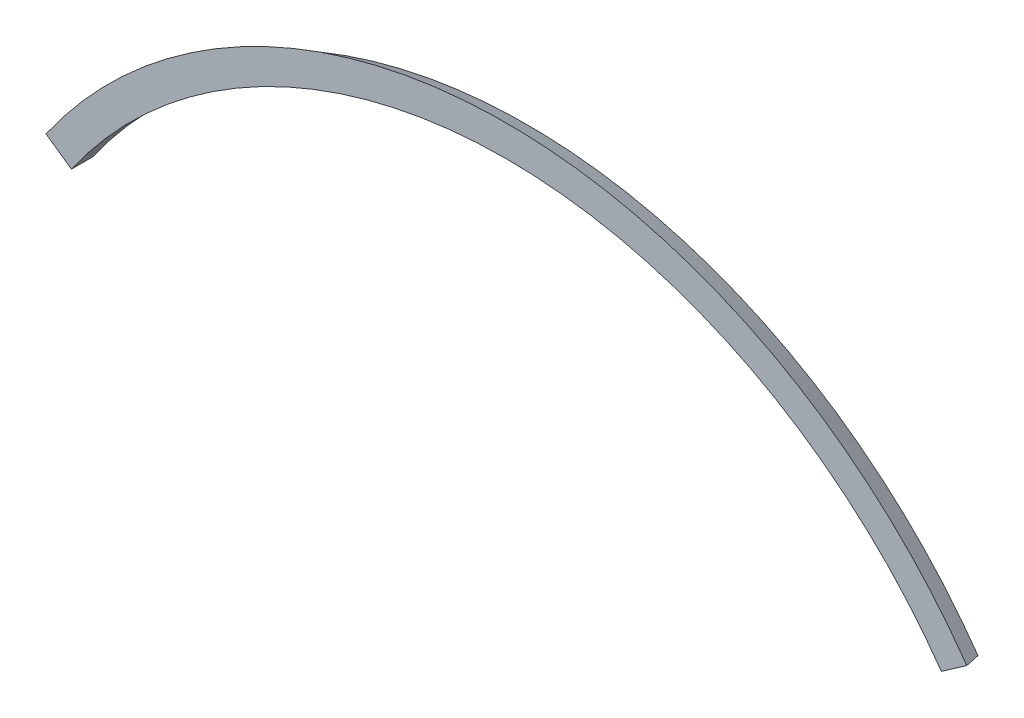
ISO-10303-21;
HEADER;
FILE_DESCRIPTION(('STEP AP214'),'2;1');
FILE_NAME('part.step','',(''),(''),'','','');
FILE_SCHEMA(('AUTOMOTIVE_DESIGN { 1 0 10303 214 1 1 1 1 }'));
ENDSEC;
DATA;
#1=APPLICATION_CONTEXT('core data for automotive mechanical design processes');
#2=APPLICATION_PROTOCOL_DEFINITION('international standard','automotive_design',2000,#1);
#3=PRODUCT_CONTEXT('',#1,'mechanical');
#4=PRODUCT('Part','Part','',(#3));
#5=PRODUCT_RELATED_PRODUCT_CATEGORY('part','',(#4));
#6=PRODUCT_DEFINITION_FORMATION('','',#4);
#7=PRODUCT_DEFINITION_CONTEXT('part definition',#1,'design');
#8=PRODUCT_DEFINITION('design','',#6,#7);
#9=PRODUCT_DEFINITION_SHAPE('','',#8);
#10=(LENGTH_UNIT() NAMED_UNIT(*) SI_UNIT(.MILLI.,.METRE.));
#11=(NAMED_UNIT(*) PLANE_ANGLE_UNIT() SI_UNIT($,.RADIAN.));
#12=(NAMED_UNIT(*) SI_UNIT($,.STERADIAN.) SOLID_ANGLE_UNIT());
#13=UNCERTAINTY_MEASURE_WITH_UNIT(LENGTH_MEASURE(1.E-05),#10,'distance_accuracy_value','');
#14=(GEOMETRIC_REPRESENTATION_CONTEXT(3) GLOBAL_UNCERTAINTY_ASSIGNED_CONTEXT((#13)) GLOBAL_UNIT_ASSIGNED_CONTEXT((#10,
#11,#12)) REPRESENTATION_CONTEXT('',''));
#15=CARTESIAN_POINT('',(0.,0.,0.));
#16=DIRECTION('',(0.,0.,1.));
#17=DIRECTION('',(1.,0.,0.));
#18=AXIS2_PLACEMENT_3D('',#15,#16,#17);
#19=CARTESIAN_POINT('',(-40.9576022144498,28.6788218175521,2.));
#20=DIRECTION('',(-0.573576436351041,-0.819152044288995,0.));
#21=DIRECTION('',(0.819152044288995,-0.573576436351041,0.));
#22=AXIS2_PLACEMENT_3D('',#19,#20,#21);
#23=PLANE('',#22);
#24=DIRECTION('',(-0.819152044288995,0.573576436351041,0.));
#25=VECTOR('',#24,1.);
#26=CARTESIAN_POINT('',(-40.9576022144498,28.6788218175521,2.));
#27=LINE('',#26,#25);
#28=CARTESIAN_POINT('',(-40.9576022144498,28.6788218175521,2.));
#29=VERTEX_POINT('',#28);
#30=CARTESIAN_POINT('',(-43.3516967161837,30.3551848348526,2.));
#31=VERTEX_POINT('',#30);
#32=EDGE_CURVE('E83',#29,#31,#27,.T.);
#33=ORIENTED_EDGE('',*,*,#32,.T.);
#34=DIRECTION('',(0.409576022144503,-0.286788218175524,-0.866025403784435));
#35=VECTOR('',#34,1.);
#36=CARTESIAN_POINT('',(0.,0.,-89.6647182049334));
#37=LINE('',#36,#35);
#38=CARTESIAN_POINT('',(-42.4058214096288,29.6928758149964,0.));
#39=VERTEX_POINT('',#38);
#40=EDGE_CURVE('E63',#31,#39,#37,.T.);
#41=ORIENTED_EDGE('',*,*,#40,.T.);
#42=DIRECTION('',(-0.819152044288995,0.573576436351041,0.));
#43=VECTOR('',#42,1.);
#44=CARTESIAN_POINT('',(-40.9576022144498,28.6788218175521,0.));
#45=LINE('',#44,#43);
#46=CARTESIAN_POINT('',(-40.9576022144498,28.6788218175521,0.));
#47=VERTEX_POINT('',#46);
#48=EDGE_CURVE('E84',#47,#39,#45,.T.);
#49=ORIENTED_EDGE('',*,*,#48,.F.);
#50=DIRECTION('',(0.,0.,-1.));
#51=VECTOR('',#50,1.);
#52=CARTESIAN_POINT('',(-40.9576022144498,28.6788218175521,2.));
#53=LINE('',#52,#51);
#54=EDGE_CURVE('E81',#29,#47,#53,.T.);
#55=ORIENTED_EDGE('',*,*,#54,.F.);
#56=EDGE_LOOP('',(#33,#41,#49,#55));
#57=FACE_BOUND('',#56,.T.);
#58=ADVANCED_FACE('F41',(#57),#23,.T.);
#59=CARTESIAN_POINT('',(0.,0.,2.));
#60=DIRECTION('',(0.,0.,-1.));
#61=DIRECTION('',(-1.,0.,0.));
#62=AXIS2_PLACEMENT_3D('',#59,#60,#61);
#63=CYLINDRICAL_SURFACE('',#62,50.);
#64=CARTESIAN_POINT('',(0.,0.,0.));
#65=DIRECTION('',(0.,0.,1.));
#66=DIRECTION('',(1.,0.,0.));
#67=AXIS2_PLACEMENT_3D('',#64,#65,#66);
#68=CIRCLE('',#67,50.);
#69=CARTESIAN_POINT('',(40.9576022144495,28.6788218175524,0.));
#70=VERTEX_POINT('',#69);
#71=EDGE_CURVE('E107',#70,#47,#68,.T.);
#72=ORIENTED_EDGE('',*,*,#71,.F.);
#73=DIRECTION('',(0.,0.,-1.));
#74=VECTOR('',#73,1.);
#75=CARTESIAN_POINT('',(40.9576022144495,28.6788218175524,2.));
#76=LINE('',#75,#74);
#77=CARTESIAN_POINT('',(40.9576022144495,28.6788218175524,2.));
#78=VERTEX_POINT('',#77);
#79=EDGE_CURVE('E90',#78,#70,#76,.T.);
#80=ORIENTED_EDGE('',*,*,#79,.F.);
#81=CARTESIAN_POINT('',(0.,0.,2.));
#82=DIRECTION('',(0.,0.,1.));
#83=DIRECTION('',(1.,0.,0.));
#84=AXIS2_PLACEMENT_3D('',#81,#82,#83);
#85=CIRCLE('',#84,50.);
#86=EDGE_CURVE('E96',#78,#29,#85,.T.);
#87=ORIENTED_EDGE('',*,*,#86,.T.);
#88=ORIENTED_EDGE('',*,*,#54,.T.);
#89=EDGE_LOOP('',(#72,#80,#87,#88));
#90=FACE_BOUND('',#89,.T.);
#91=ADVANCED_FACE('F100',(#90),#63,.F.);
#92=CARTESIAN_POINT('',(43.824634369461,30.686339344781,2.));
#93=DIRECTION('',(0.573576436351048,-0.819152044288991,0.));
#94=DIRECTION('',(0.819152044288991,0.573576436351048,0.));
#95=AXIS2_PLACEMENT_3D('',#92,#93,#94);
#96=PLANE('',#95);
#97=DIRECTION('',(-0.819152044288991,-0.573576436351048,0.));
#98=VECTOR('',#97,1.);
#99=CARTESIAN_POINT('',(43.824634369461,30.686339344781,0.));
#100=LINE('',#99,#98);
#101=CARTESIAN_POINT('',(42.4058214096285,29.6928758149967,0.));
#102=VERTEX_POINT('',#101);
#103=EDGE_CURVE('E97',#102,#70,#100,.T.);
#104=ORIENTED_EDGE('',*,*,#103,.F.);
#105=DIRECTION('',(0.409576022144501,0.286788218175527,0.866025403784435));
#106=VECTOR('',#105,1.);
#107=CARTESIAN_POINT('',(0.,0.,-89.6647182049334));
#108=LINE('',#107,#106);
#109=CARTESIAN_POINT('',(43.3516967161835,30.3551848348529,2.));
#110=VERTEX_POINT('',#109);
#111=EDGE_CURVE('E11',#102,#110,#108,.T.);
#112=ORIENTED_EDGE('',*,*,#111,.T.);
#113=DIRECTION('',(-0.819152044288991,-0.573576436351048,0.));
#114=VECTOR('',#113,1.);
#115=CARTESIAN_POINT('',(43.824634369461,30.686339344781,2.));
#116=LINE('',#115,#114);
#117=EDGE_CURVE('E102',#110,#78,#116,.T.);
#118=ORIENTED_EDGE('',*,*,#117,.T.);
#119=ORIENTED_EDGE('',*,*,#79,.T.);
#120=EDGE_LOOP('',(#104,#112,#118,#119));
#121=FACE_BOUND('',#120,.T.);
#122=ADVANCED_FACE('F116',(#121),#96,.T.);
#123=CARTESIAN_POINT('',(0.,0.,2.));
#124=DIRECTION('',(0.,0.,1.));
#125=DIRECTION('',(1.,0.,0.));
#126=AXIS2_PLACEMENT_3D('',#123,#124,#125);
#127=PLANE('',#126);
#128=ORIENTED_EDGE('',*,*,#117,.F.);
#129=CARTESIAN_POINT('',(0.,0.,2.));
#130=DIRECTION('',(0.,0.,1.));
#131=DIRECTION('',(1.,0.,0.));
#132=AXIS2_PLACEMENT_3D('',#129,#130,#131);
#133=CIRCLE('',#132,52.9226497308103);
#134=EDGE_CURVE('E89',#110,#31,#133,.T.);
#135=ORIENTED_EDGE('',*,*,#134,.T.);
#136=ORIENTED_EDGE('',*,*,#32,.F.);
#137=ORIENTED_EDGE('',*,*,#86,.F.);
#138=EDGE_LOOP('',(#128,#135,#136,#137));
#139=FACE_BOUND('',#138,.T.);
#140=ADVANCED_FACE('F95',(#139),#127,.T.);
#141=CARTESIAN_POINT('',(0.,0.,0.));
#142=DIRECTION('',(0.,0.,1.));
#143=DIRECTION('',(1.,0.,0.));
#144=AXIS2_PLACEMENT_3D('',#141,#142,#143);
#145=PLANE('',#144);
#146=ORIENTED_EDGE('',*,*,#48,.T.);
#147=CARTESIAN_POINT('',(0.,0.,0.));
#148=DIRECTION('',(0.,0.,1.));
#149=DIRECTION('',(1.,0.,0.));
#150=AXIS2_PLACEMENT_3D('',#147,#148,#149);
#151=CIRCLE('',#150,51.7679491924311);
#152=EDGE_CURVE('E50',#39,#102,#151,.F.);
#153=ORIENTED_EDGE('',*,*,#152,.T.);
#154=ORIENTED_EDGE('',*,*,#103,.T.);
#155=ORIENTED_EDGE('',*,*,#71,.T.);
#156=EDGE_LOOP('',(#146,#153,#154,#155));
#157=FACE_BOUND('',#156,.T.);
#158=ADVANCED_FACE('F114',(#157),#145,.F.);
#159=CARTESIAN_POINT('',(0.,0.,3.00000000000001));
#160=DIRECTION('',(0.,0.,1.));
#161=DIRECTION('',(1.,0.,0.));
#162=AXIS2_PLACEMENT_3D('',#159,#160,#161);
#163=CONICAL_SURFACE('',#162,53.5,0.523598775598306);
#164=ORIENTED_EDGE('',*,*,#111,.F.);
#165=ORIENTED_EDGE('',*,*,#152,.F.);
#166=ORIENTED_EDGE('',*,*,#40,.F.);
#167=ORIENTED_EDGE('',*,*,#134,.F.);
#168=EDGE_LOOP('',(#164,#165,#166,#167));
#169=FACE_BOUND('',#168,.T.);
#170=ADVANCED_FACE('F44',(#169),#163,.T.);
#171=CLOSED_SHELL('',(#58,#91,#122,#140,#158,#170));
#172=MANIFOLD_SOLID_BREP('B2',#171);
#173=ADVANCED_BREP_SHAPE_REPRESENTATION('',(#18,#172),#14);
#174=SHAPE_DEFINITION_REPRESENTATION(#9,#173);
ENDSEC;
END-ISO-10303-21;
